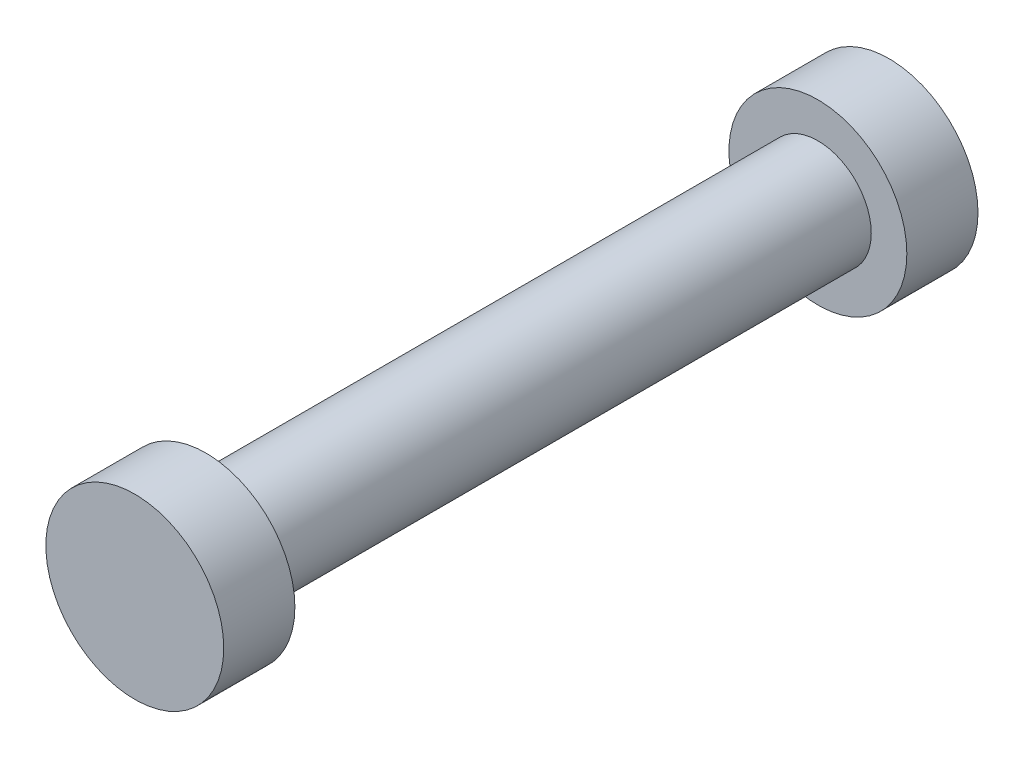
ISO-10303-21;
HEADER;
FILE_DESCRIPTION(('STEP AP214'),'2;1');
FILE_NAME('part.step','',(''),(''),'','','');
FILE_SCHEMA(('AUTOMOTIVE_DESIGN { 1 0 10303 214 1 1 1 1 }'));
ENDSEC;
DATA;
#1=APPLICATION_CONTEXT('core data for automotive mechanical design processes');
#2=APPLICATION_PROTOCOL_DEFINITION('international standard','automotive_design',2000,#1);
#3=PRODUCT_CONTEXT('',#1,'mechanical');
#4=PRODUCT('Part','Part','',(#3));
#5=PRODUCT_RELATED_PRODUCT_CATEGORY('part','',(#4));
#6=PRODUCT_DEFINITION_FORMATION('','',#4);
#7=PRODUCT_DEFINITION_CONTEXT('part definition',#1,'design');
#8=PRODUCT_DEFINITION('design','',#6,#7);
#9=PRODUCT_DEFINITION_SHAPE('','',#8);
#10=(LENGTH_UNIT() NAMED_UNIT(*) SI_UNIT(.MILLI.,.METRE.));
#11=(NAMED_UNIT(*) PLANE_ANGLE_UNIT() SI_UNIT($,.RADIAN.));
#12=(NAMED_UNIT(*) SI_UNIT($,.STERADIAN.) SOLID_ANGLE_UNIT());
#13=UNCERTAINTY_MEASURE_WITH_UNIT(LENGTH_MEASURE(1.E-05),#10,'distance_accuracy_value','');
#14=(GEOMETRIC_REPRESENTATION_CONTEXT(3) GLOBAL_UNCERTAINTY_ASSIGNED_CONTEXT((#13)) GLOBAL_UNIT_ASSIGNED_CONTEXT((#10,
#11,#12)) REPRESENTATION_CONTEXT('',''));
#15=CARTESIAN_POINT('',(0.,0.,0.));
#16=DIRECTION('',(0.,0.,1.));
#17=DIRECTION('',(1.,0.,0.));
#18=AXIS2_PLACEMENT_3D('',#15,#16,#17);
#19=CARTESIAN_POINT('',(0.,0.,10.));
#20=DIRECTION('',(0.,0.,-1.));
#21=DIRECTION('',(-1.,0.,0.));
#22=AXIS2_PLACEMENT_3D('',#19,#20,#21);
#23=CYLINDRICAL_SURFACE('',#22,12.5);
#24=CARTESIAN_POINT('',(0.,0.,10.));
#25=DIRECTION('',(0.,0.,1.));
#26=DIRECTION('',(1.,0.,0.));
#27=AXIS2_PLACEMENT_3D('',#24,#25,#26);
#28=CIRCLE('',#27,12.5);
#29=CARTESIAN_POINT('',(12.5,0.,10.));
#30=VERTEX_POINT('',#29);
#31=EDGE_CURVE('E45',#30,#30,#28,.T.);
#32=ORIENTED_EDGE('',*,*,#31,.F.);
#33=EDGE_LOOP('',(#32));
#34=FACE_BOUND('',#33,.T.);
#35=CARTESIAN_POINT('',(0.,0.,0.));
#36=DIRECTION('',(0.,0.,1.));
#37=DIRECTION('',(1.,0.,0.));
#38=AXIS2_PLACEMENT_3D('',#35,#36,#37);
#39=CIRCLE('',#38,12.5);
#40=CARTESIAN_POINT('',(12.5,0.,0.));
#41=VERTEX_POINT('',#40);
#42=EDGE_CURVE('E40',#41,#41,#39,.T.);
#43=ORIENTED_EDGE('',*,*,#42,.T.);
#44=EDGE_LOOP('',(#43));
#45=FACE_BOUND('',#44,.T.);
#46=ADVANCED_FACE('F37',(#34,#45),#23,.T.);
#47=CARTESIAN_POINT('',(0.,0.,10.));
#48=DIRECTION('',(0.,0.,1.));
#49=DIRECTION('',(1.,0.,0.));
#50=AXIS2_PLACEMENT_3D('',#47,#48,#49);
#51=PLANE('',#50);
#52=CARTESIAN_POINT('',(0.,0.,10.));
#53=DIRECTION('',(0.,0.,1.));
#54=DIRECTION('',(1.,0.,0.));
#55=AXIS2_PLACEMENT_3D('',#52,#53,#54);
#56=CIRCLE('',#55,7.5);
#57=CARTESIAN_POINT('',(7.5,0.,10.));
#58=VERTEX_POINT('',#57);
#59=EDGE_CURVE('E10',#58,#58,#56,.T.);
#60=ORIENTED_EDGE('',*,*,#59,.F.);
#61=EDGE_LOOP('',(#60));
#62=FACE_BOUND('',#61,.T.);
#63=ORIENTED_EDGE('',*,*,#31,.T.);
#64=EDGE_LOOP('',(#63));
#65=FACE_BOUND('',#64,.T.);
#66=ADVANCED_FACE('F83',(#62,#65),#51,.T.);
#67=CARTESIAN_POINT('',(0.,0.,0.));
#68=DIRECTION('',(0.,0.,1.));
#69=DIRECTION('',(1.,0.,0.));
#70=AXIS2_PLACEMENT_3D('',#67,#68,#69);
#71=PLANE('',#70);
#72=ORIENTED_EDGE('',*,*,#42,.F.);
#73=EDGE_LOOP('',(#72));
#74=FACE_BOUND('',#73,.T.);
#75=ADVANCED_FACE('F88',(#74),#71,.F.);
#76=CARTESIAN_POINT('',(0.,0.,96.));
#77=DIRECTION('',(0.,0.,-1.));
#78=DIRECTION('',(-1.,0.,0.));
#79=AXIS2_PLACEMENT_3D('',#76,#77,#78);
#80=CYLINDRICAL_SURFACE('',#79,7.5);
#81=CARTESIAN_POINT('',(0.,0.,96.));
#82=DIRECTION('',(0.,0.,1.));
#83=DIRECTION('',(1.,0.,0.));
#84=AXIS2_PLACEMENT_3D('',#81,#82,#83);
#85=CIRCLE('',#84,7.5);
#86=CARTESIAN_POINT('',(7.5,0.,96.));
#87=VERTEX_POINT('',#86);
#88=EDGE_CURVE('E52',#87,#87,#85,.T.);
#89=ORIENTED_EDGE('',*,*,#88,.F.);
#90=EDGE_LOOP('',(#89));
#91=FACE_BOUND('',#90,.T.);
#92=ORIENTED_EDGE('',*,*,#59,.T.);
#93=EDGE_LOOP('',(#92));
#94=FACE_BOUND('',#93,.T.);
#95=ADVANCED_FACE('F70',(#91,#94),#80,.T.);
#96=CARTESIAN_POINT('',(0.,0.,106.));
#97=DIRECTION('',(0.,0.,-1.));
#98=DIRECTION('',(-1.,0.,0.));
#99=AXIS2_PLACEMENT_3D('',#96,#97,#98);
#100=CYLINDRICAL_SURFACE('',#99,12.5);
#101=CARTESIAN_POINT('',(0.,0.,106.));
#102=DIRECTION('',(0.,0.,1.));
#103=DIRECTION('',(1.,0.,0.));
#104=AXIS2_PLACEMENT_3D('',#101,#102,#103);
#105=CIRCLE('',#104,12.5);
#106=CARTESIAN_POINT('',(12.5,0.,106.));
#107=VERTEX_POINT('',#106);
#108=EDGE_CURVE('E56',#107,#107,#105,.T.);
#109=ORIENTED_EDGE('',*,*,#108,.F.);
#110=EDGE_LOOP('',(#109));
#111=FACE_BOUND('',#110,.T.);
#112=CARTESIAN_POINT('',(0.,0.,96.));
#113=DIRECTION('',(0.,0.,1.));
#114=DIRECTION('',(1.,0.,0.));
#115=AXIS2_PLACEMENT_3D('',#112,#113,#114);
#116=CIRCLE('',#115,12.5);
#117=CARTESIAN_POINT('',(12.5,0.,96.));
#118=VERTEX_POINT('',#117);
#119=EDGE_CURVE('E57',#118,#118,#116,.T.);
#120=ORIENTED_EDGE('',*,*,#119,.T.);
#121=EDGE_LOOP('',(#120));
#122=FACE_BOUND('',#121,.T.);
#123=ADVANCED_FACE('F67',(#111,#122),#100,.T.);
#124=CARTESIAN_POINT('',(0.,0.,106.));
#125=DIRECTION('',(0.,0.,1.));
#126=DIRECTION('',(1.,0.,0.));
#127=AXIS2_PLACEMENT_3D('',#124,#125,#126);
#128=PLANE('',#127);
#129=ORIENTED_EDGE('',*,*,#108,.T.);
#130=EDGE_LOOP('',(#129));
#131=FACE_BOUND('',#130,.T.);
#132=ADVANCED_FACE('F65',(#131),#128,.T.);
#133=CARTESIAN_POINT('',(0.,0.,96.));
#134=DIRECTION('',(0.,0.,1.));
#135=DIRECTION('',(1.,0.,0.));
#136=AXIS2_PLACEMENT_3D('',#133,#134,#135);
#137=PLANE('',#136);
#138=ORIENTED_EDGE('',*,*,#88,.T.);
#139=EDGE_LOOP('',(#138));
#140=FACE_BOUND('',#139,.T.);
#141=ORIENTED_EDGE('',*,*,#119,.F.);
#142=EDGE_LOOP('',(#141));
#143=FACE_BOUND('',#142,.T.);
#144=ADVANCED_FACE('F74',(#140,#143),#137,.F.);
#145=CLOSED_SHELL('',(#46,#66,#75,#95,#123,#132,#144));
#146=MANIFOLD_SOLID_BREP('B2',#145);
#147=ADVANCED_BREP_SHAPE_REPRESENTATION('',(#18,#146),#14);
#148=SHAPE_DEFINITION_REPRESENTATION(#9,#147);
ENDSEC;
END-ISO-10303-21;
